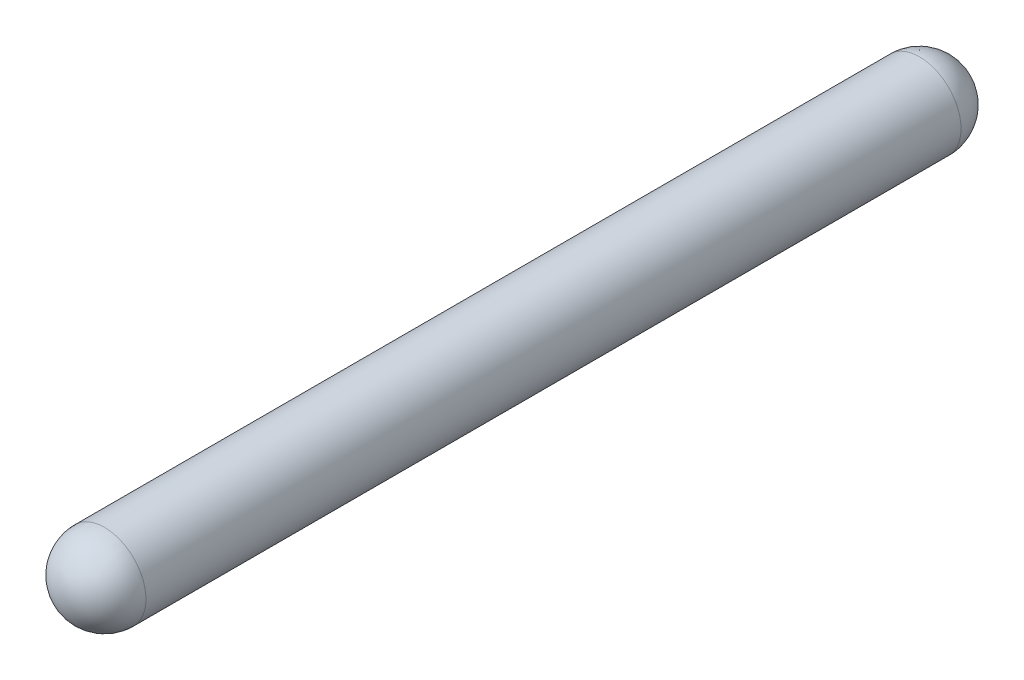
ISO-10303-21;
HEADER;
FILE_DESCRIPTION(('STEP AP214'),'2;1');
FILE_NAME('part.step','',(''),(''),'','','');
FILE_SCHEMA(('AUTOMOTIVE_DESIGN { 1 0 10303 214 1 1 1 1 }'));
ENDSEC;
DATA;
#1=APPLICATION_CONTEXT('core data for automotive mechanical design processes');
#2=APPLICATION_PROTOCOL_DEFINITION('international standard','automotive_design',2000,#1);
#3=PRODUCT_CONTEXT('',#1,'mechanical');
#4=PRODUCT('Part','Part','',(#3));
#5=PRODUCT_RELATED_PRODUCT_CATEGORY('part','',(#4));
#6=PRODUCT_DEFINITION_FORMATION('','',#4);
#7=PRODUCT_DEFINITION_CONTEXT('part definition',#1,'design');
#8=PRODUCT_DEFINITION('design','',#6,#7);
#9=PRODUCT_DEFINITION_SHAPE('','',#8);
#10=(LENGTH_UNIT() NAMED_UNIT(*) SI_UNIT(.MILLI.,.METRE.));
#11=(NAMED_UNIT(*) PLANE_ANGLE_UNIT() SI_UNIT($,.RADIAN.));
#12=(NAMED_UNIT(*) SI_UNIT($,.STERADIAN.) SOLID_ANGLE_UNIT());
#13=UNCERTAINTY_MEASURE_WITH_UNIT(LENGTH_MEASURE(1.E-05),#10,'distance_accuracy_value','');
#14=(GEOMETRIC_REPRESENTATION_CONTEXT(3) GLOBAL_UNCERTAINTY_ASSIGNED_CONTEXT((#13)) GLOBAL_UNIT_ASSIGNED_CONTEXT((#10,
#11,#12)) REPRESENTATION_CONTEXT('',''));
#15=CARTESIAN_POINT('',(0.,0.,0.));
#16=DIRECTION('',(0.,0.,1.));
#17=DIRECTION('',(1.,0.,0.));
#18=AXIS2_PLACEMENT_3D('',#15,#16,#17);
#19=CARTESIAN_POINT('',(-0.936,-11.23,-3.));
#20=DIRECTION('',(1.,0.,0.));
#21=DIRECTION('',(0.,-1.,0.));
#22=AXIS2_PLACEMENT_3D('',#19,#20,#21);
#23=SPHERICAL_SURFACE('',#22,0.331);
#24=CARTESIAN_POINT('',(-0.936,-11.23,-3.));
#25=DIRECTION('',(0.,0.,1.));
#26=DIRECTION('',(1.,0.,0.));
#27=AXIS2_PLACEMENT_3D('',#24,#25,#26);
#28=CIRCLE('',#27,0.331);
#29=CARTESIAN_POINT('',(-0.605,-11.23,-3.));
#30=VERTEX_POINT('',#29);
#31=CARTESIAN_POINT('',(-1.267,-11.23,-3.));
#32=VERTEX_POINT('',#31);
#33=EDGE_CURVE('E42',#30,#32,#28,.T.);
#34=ORIENTED_EDGE('',*,*,#33,.F.);
#35=CARTESIAN_POINT('',(-0.936,-11.23,-3.));
#36=DIRECTION('',(0.,0.,1.));
#37=DIRECTION('',(1.,0.,0.));
#38=AXIS2_PLACEMENT_3D('',#35,#36,#37);
#39=CIRCLE('',#38,0.331);
#40=EDGE_CURVE('E26',#32,#30,#39,.T.);
#41=ORIENTED_EDGE('',*,*,#40,.F.);
#42=EDGE_LOOP('',(#34,#41));
#43=FACE_BOUND('',#42,.T.);
#44=ADVANCED_FACE('F17',(#43),#23,.T.);
#45=CARTESIAN_POINT('',(-0.936,-11.23,3.5));
#46=DIRECTION('',(1.,0.,0.));
#47=DIRECTION('',(0.,1.,0.));
#48=AXIS2_PLACEMENT_3D('',#45,#46,#47);
#49=SPHERICAL_SURFACE('',#48,0.331);
#50=CARTESIAN_POINT('',(-0.936,-11.23,3.5));
#51=DIRECTION('',(0.,0.,1.));
#52=DIRECTION('',(1.,0.,0.));
#53=AXIS2_PLACEMENT_3D('',#50,#51,#52);
#54=CIRCLE('',#53,0.331);
#55=CARTESIAN_POINT('',(-0.605,-11.23,3.5));
#56=VERTEX_POINT('',#55);
#57=CARTESIAN_POINT('',(-1.267,-11.23,3.5));
#58=VERTEX_POINT('',#57);
#59=EDGE_CURVE('E11',#56,#58,#54,.F.);
#60=ORIENTED_EDGE('',*,*,#59,.F.);
#61=CARTESIAN_POINT('',(-0.936,-11.23,3.5));
#62=DIRECTION('',(0.,0.,1.));
#63=DIRECTION('',(1.,0.,0.));
#64=AXIS2_PLACEMENT_3D('',#61,#62,#63);
#65=CIRCLE('',#64,0.331);
#66=EDGE_CURVE('E34',#58,#56,#65,.F.);
#67=ORIENTED_EDGE('',*,*,#66,.F.);
#68=EDGE_LOOP('',(#60,#67));
#69=FACE_BOUND('',#68,.T.);
#70=ADVANCED_FACE('F49',(#69),#49,.T.);
#71=CARTESIAN_POINT('',(-0.936,-11.23,-3.));
#72=DIRECTION('',(0.,0.,1.));
#73=DIRECTION('',(1.,0.,0.));
#74=AXIS2_PLACEMENT_3D('',#71,#72,#73);
#75=CYLINDRICAL_SURFACE('',#74,0.331);
#76=ORIENTED_EDGE('',*,*,#66,.T.);
#77=ORIENTED_EDGE('',*,*,#59,.T.);
#78=EDGE_LOOP('',(#76,#77));
#79=FACE_BOUND('',#78,.T.);
#80=ORIENTED_EDGE('',*,*,#40,.T.);
#81=ORIENTED_EDGE('',*,*,#33,.T.);
#82=EDGE_LOOP('',(#80,#81));
#83=FACE_BOUND('',#82,.T.);
#84=ADVANCED_FACE('F45',(#79,#83),#75,.T.);
#85=CLOSED_SHELL('',(#44,#70,#84));
#86=MANIFOLD_SOLID_BREP('B1',#85);
#87=ADVANCED_BREP_SHAPE_REPRESENTATION('',(#18,#86),#14);
#88=SHAPE_DEFINITION_REPRESENTATION(#9,#87);
ENDSEC;
END-ISO-10303-21;
